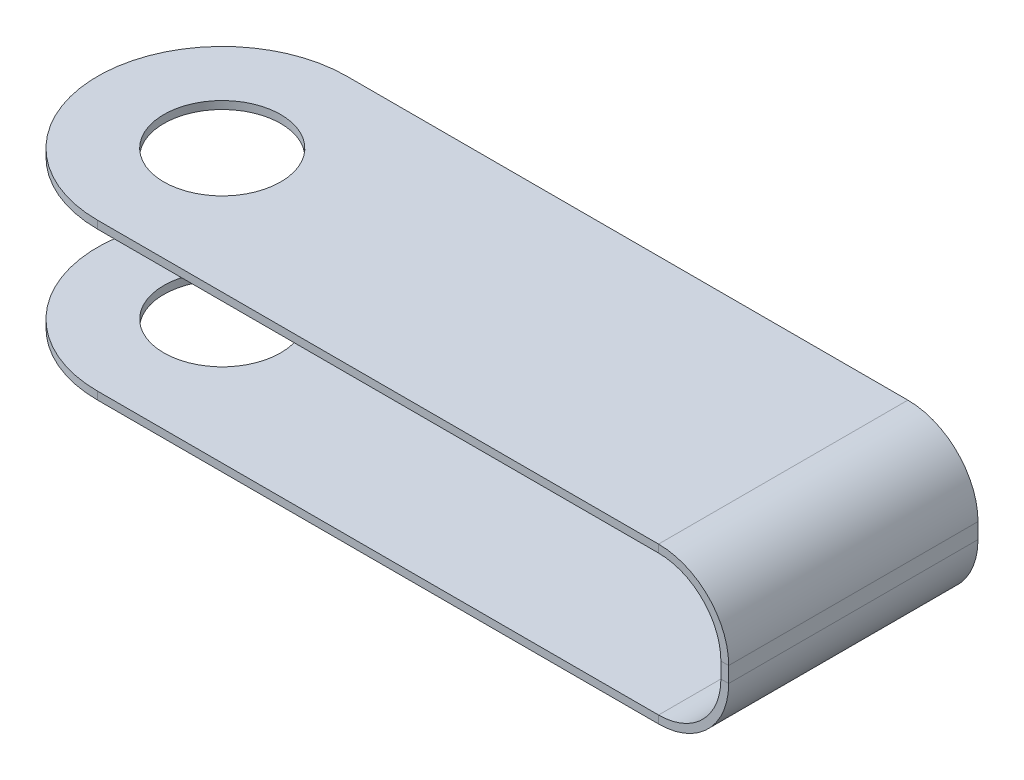
ISO-10303-21;
HEADER;
FILE_DESCRIPTION(('STEP AP214'),'2;1');
FILE_NAME('part.step','',(''),(''),'','','');
FILE_SCHEMA(('AUTOMOTIVE_DESIGN { 1 0 10303 214 1 1 1 1 }'));
ENDSEC;
DATA;
#1=APPLICATION_CONTEXT('core data for automotive mechanical design processes');
#2=APPLICATION_PROTOCOL_DEFINITION('international standard','automotive_design',2000,#1);
#3=PRODUCT_CONTEXT('',#1,'mechanical');
#4=PRODUCT('Part','Part','',(#3));
#5=PRODUCT_RELATED_PRODUCT_CATEGORY('part','',(#4));
#6=PRODUCT_DEFINITION_FORMATION('','',#4);
#7=PRODUCT_DEFINITION_CONTEXT('part definition',#1,'design');
#8=PRODUCT_DEFINITION('design','',#6,#7);
#9=PRODUCT_DEFINITION_SHAPE('','',#8);
#10=(LENGTH_UNIT() NAMED_UNIT(*) SI_UNIT(.MILLI.,.METRE.));
#11=(NAMED_UNIT(*) PLANE_ANGLE_UNIT() SI_UNIT($,.RADIAN.));
#12=(NAMED_UNIT(*) SI_UNIT($,.STERADIAN.) SOLID_ANGLE_UNIT());
#13=UNCERTAINTY_MEASURE_WITH_UNIT(LENGTH_MEASURE(1.E-05),#10,'distance_accuracy_value','');
#14=(GEOMETRIC_REPRESENTATION_CONTEXT(3) GLOBAL_UNCERTAINTY_ASSIGNED_CONTEXT((#13)) GLOBAL_UNIT_ASSIGNED_CONTEXT((#10,
#11,#12)) REPRESENTATION_CONTEXT('',''));
#15=CARTESIAN_POINT('',(0.,0.,0.));
#16=DIRECTION('',(0.,0.,1.));
#17=DIRECTION('',(1.,0.,0.));
#18=AXIS2_PLACEMENT_3D('',#15,#16,#17);
#19=CARTESIAN_POINT('',(44.,9.5,16.));
#20=DIRECTION('',(0.,-1.,0.));
#21=DIRECTION('',(1.,0.,0.));
#22=AXIS2_PLACEMENT_3D('',#19,#20,#21);
#23=PLANE('',#22);
#24=CARTESIAN_POINT('',(8.,9.49999999999999,8.));
#25=DIRECTION('',(0.,-1.,0.));
#26=DIRECTION('',(1.,0.,0.));
#27=AXIS2_PLACEMENT_3D('',#24,#25,#26);
#28=CIRCLE('',#27,3.75);
#29=CARTESIAN_POINT('',(11.75,9.49999999999999,8.));
#30=VERTEX_POINT('',#29);
#31=EDGE_CURVE('E294',#30,#30,#28,.F.);
#32=ORIENTED_EDGE('',*,*,#31,.F.);
#33=EDGE_LOOP('',(#32));
#34=FACE_BOUND('',#33,.T.);
#35=DIRECTION('',(-1.,0.,0.));
#36=VECTOR('',#35,1.);
#37=CARTESIAN_POINT('',(44.,9.5,0.));
#38=LINE('',#37,#36);
#39=CARTESIAN_POINT('',(44.,9.5,0.));
#40=VERTEX_POINT('',#39);
#41=CARTESIAN_POINT('',(8.,9.49999999999999,0.));
#42=VERTEX_POINT('',#41);
#43=EDGE_CURVE('E143',#40,#42,#38,.T.);
#44=ORIENTED_EDGE('',*,*,#43,.T.);
#45=CARTESIAN_POINT('',(8.,9.5,8.));
#46=DIRECTION('',(0.,1.,0.));
#47=DIRECTION('',(0.,0.,-1.));
#48=AXIS2_PLACEMENT_3D('',#45,#46,#47);
#49=CIRCLE('',#48,8.);
#50=CARTESIAN_POINT('',(8.,9.5,16.));
#51=VERTEX_POINT('',#50);
#52=EDGE_CURVE('E63',#42,#51,#49,.T.);
#53=ORIENTED_EDGE('',*,*,#52,.T.);
#54=DIRECTION('',(-1.,0.,0.));
#55=VECTOR('',#54,1.);
#56=CARTESIAN_POINT('',(44.,9.5,16.));
#57=LINE('',#56,#55);
#58=CARTESIAN_POINT('',(44.,9.5,16.));
#59=VERTEX_POINT('',#58);
#60=EDGE_CURVE('E141',#59,#51,#57,.T.);
#61=ORIENTED_EDGE('',*,*,#60,.F.);
#62=DIRECTION('',(0.,0.,-1.));
#63=VECTOR('',#62,1.);
#64=CARTESIAN_POINT('',(44.,9.5,16.));
#65=LINE('',#64,#63);
#66=EDGE_CURVE('E179',#59,#40,#65,.T.);
#67=ORIENTED_EDGE('',*,*,#66,.T.);
#68=EDGE_LOOP('',(#44,#53,#61,#67));
#69=FACE_BOUND('',#68,.T.);
#70=ADVANCED_FACE('F40',(#34,#69),#23,.F.);
#71=CARTESIAN_POINT('',(44.,9.,16.));
#72=DIRECTION('',(0.,-1.,0.));
#73=DIRECTION('',(1.,0.,0.));
#74=AXIS2_PLACEMENT_3D('',#71,#72,#73);
#75=PLANE('',#74);
#76=CARTESIAN_POINT('',(8.,8.99999999999999,8.));
#77=DIRECTION('',(0.,-1.,0.));
#78=DIRECTION('',(1.,0.,0.));
#79=AXIS2_PLACEMENT_3D('',#76,#77,#78);
#80=CIRCLE('',#79,3.75);
#81=CARTESIAN_POINT('',(11.75,8.99999999999999,8.));
#82=VERTEX_POINT('',#81);
#83=EDGE_CURVE('E290',#82,#82,#80,.T.);
#84=ORIENTED_EDGE('',*,*,#83,.F.);
#85=EDGE_LOOP('',(#84));
#86=FACE_BOUND('',#85,.T.);
#87=CARTESIAN_POINT('',(8.,8.99999999999999,8.));
#88=DIRECTION('',(0.,-1.,0.));
#89=DIRECTION('',(1.,0.,0.));
#90=AXIS2_PLACEMENT_3D('',#87,#88,#89);
#91=CIRCLE('',#90,8.);
#92=CARTESIAN_POINT('',(8.,8.99999999999999,0.));
#93=VERTEX_POINT('',#92);
#94=CARTESIAN_POINT('',(8.,8.99999999999999,16.));
#95=VERTEX_POINT('',#94);
#96=EDGE_CURVE('E129',#93,#95,#91,.F.);
#97=ORIENTED_EDGE('',*,*,#96,.F.);
#98=DIRECTION('',(-1.,0.,0.));
#99=VECTOR('',#98,1.);
#100=CARTESIAN_POINT('',(44.,9.,0.));
#101=LINE('',#100,#99);
#102=CARTESIAN_POINT('',(44.,9.,0.));
#103=VERTEX_POINT('',#102);
#104=EDGE_CURVE('E181',#103,#93,#101,.T.);
#105=ORIENTED_EDGE('',*,*,#104,.F.);
#106=DIRECTION('',(0.,0.,-1.));
#107=VECTOR('',#106,1.);
#108=CARTESIAN_POINT('',(44.,9.,16.));
#109=LINE('',#108,#107);
#110=CARTESIAN_POINT('',(44.,9.,16.));
#111=VERTEX_POINT('',#110);
#112=EDGE_CURVE('E221',#111,#103,#109,.T.);
#113=ORIENTED_EDGE('',*,*,#112,.F.);
#114=DIRECTION('',(-1.,0.,0.));
#115=VECTOR('',#114,1.);
#116=CARTESIAN_POINT('',(44.,9.,16.));
#117=LINE('',#116,#115);
#118=EDGE_CURVE('E148',#111,#95,#117,.T.);
#119=ORIENTED_EDGE('',*,*,#118,.T.);
#120=EDGE_LOOP('',(#97,#105,#113,#119));
#121=FACE_BOUND('',#120,.T.);
#122=ADVANCED_FACE('F273',(#86,#121),#75,.T.);
#123=CARTESIAN_POINT('',(0.,0.,16.));
#124=DIRECTION('',(0.,1.,0.));
#125=DIRECTION('',(0.,0.,1.));
#126=AXIS2_PLACEMENT_3D('',#123,#124,#125);
#127=PLANE('',#126);
#128=CARTESIAN_POINT('',(8.,0.,8.));
#129=DIRECTION('',(0.,1.,0.));
#130=DIRECTION('',(0.,0.,1.));
#131=AXIS2_PLACEMENT_3D('',#128,#129,#130);
#132=CIRCLE('',#131,3.75);
#133=CARTESIAN_POINT('',(8.,0.,11.75));
#134=VERTEX_POINT('',#133);
#135=EDGE_CURVE('E297',#134,#134,#132,.T.);
#136=ORIENTED_EDGE('',*,*,#135,.F.);
#137=EDGE_LOOP('',(#136));
#138=FACE_BOUND('',#137,.T.);
#139=CARTESIAN_POINT('',(8.,0.,8.));
#140=DIRECTION('',(0.,1.,0.));
#141=DIRECTION('',(0.,0.,1.));
#142=AXIS2_PLACEMENT_3D('',#139,#140,#141);
#143=CIRCLE('',#142,8.);
#144=CARTESIAN_POINT('',(8.,0.,16.));
#145=VERTEX_POINT('',#144);
#146=CARTESIAN_POINT('',(8.,0.,0.));
#147=VERTEX_POINT('',#146);
#148=EDGE_CURVE('E287',#145,#147,#143,.F.);
#149=ORIENTED_EDGE('',*,*,#148,.F.);
#150=DIRECTION('',(1.,0.,0.));
#151=VECTOR('',#150,1.);
#152=CARTESIAN_POINT('',(0.,0.,16.));
#153=LINE('',#152,#151);
#154=CARTESIAN_POINT('',(44.,0.,16.));
#155=VERTEX_POINT('',#154);
#156=EDGE_CURVE('E167',#145,#155,#153,.T.);
#157=ORIENTED_EDGE('',*,*,#156,.T.);
#158=DIRECTION('',(0.,0.,-1.));
#159=VECTOR('',#158,1.);
#160=CARTESIAN_POINT('',(44.,0.,16.));
#161=LINE('',#160,#159);
#162=CARTESIAN_POINT('',(44.,0.,0.));
#163=VERTEX_POINT('',#162);
#164=EDGE_CURVE('E212',#155,#163,#161,.T.);
#165=ORIENTED_EDGE('',*,*,#164,.T.);
#166=DIRECTION('',(1.,0.,0.));
#167=VECTOR('',#166,1.);
#168=CARTESIAN_POINT('',(0.,0.,0.));
#169=LINE('',#168,#167);
#170=EDGE_CURVE('E193',#147,#163,#169,.T.);
#171=ORIENTED_EDGE('',*,*,#170,.F.);
#172=EDGE_LOOP('',(#149,#157,#165,#171));
#173=FACE_BOUND('',#172,.T.);
#174=ADVANCED_FACE('F309',(#138,#173),#127,.T.);
#175=CARTESIAN_POINT('',(0.,-0.5,16.));
#176=DIRECTION('',(0.,1.,0.));
#177=DIRECTION('',(0.,0.,1.));
#178=AXIS2_PLACEMENT_3D('',#175,#176,#177);
#179=PLANE('',#178);
#180=CARTESIAN_POINT('',(8.,-0.5,8.));
#181=DIRECTION('',(0.,-1.,0.));
#182=DIRECTION('',(0.,0.,-1.));
#183=AXIS2_PLACEMENT_3D('',#180,#181,#182);
#184=CIRCLE('',#183,3.75);
#185=CARTESIAN_POINT('',(8.,-0.5,4.25));
#186=VERTEX_POINT('',#185);
#187=EDGE_CURVE('E300',#186,#186,#184,.T.);
#188=ORIENTED_EDGE('',*,*,#187,.F.);
#189=EDGE_LOOP('',(#188));
#190=FACE_BOUND('',#189,.T.);
#191=DIRECTION('',(1.,0.,0.));
#192=VECTOR('',#191,1.);
#193=CARTESIAN_POINT('',(0.,-0.5,16.));
#194=LINE('',#193,#192);
#195=CARTESIAN_POINT('',(8.,-0.5,16.));
#196=VERTEX_POINT('',#195);
#197=CARTESIAN_POINT('',(44.,-0.5,16.));
#198=VERTEX_POINT('',#197);
#199=EDGE_CURVE('E169',#196,#198,#194,.T.);
#200=ORIENTED_EDGE('',*,*,#199,.F.);
#201=CARTESIAN_POINT('',(8.,-0.5,8.));
#202=DIRECTION('',(0.,1.,0.));
#203=DIRECTION('',(0.,0.,-1.));
#204=AXIS2_PLACEMENT_3D('',#201,#202,#203);
#205=CIRCLE('',#204,8.);
#206=CARTESIAN_POINT('',(8.,-0.5,0.));
#207=VERTEX_POINT('',#206);
#208=EDGE_CURVE('E55',#207,#196,#205,.T.);
#209=ORIENTED_EDGE('',*,*,#208,.F.);
#210=DIRECTION('',(1.,0.,0.));
#211=VECTOR('',#210,1.);
#212=CARTESIAN_POINT('',(0.,-0.5,0.));
#213=LINE('',#212,#211);
#214=CARTESIAN_POINT('',(44.,-0.5,0.));
#215=VERTEX_POINT('',#214);
#216=EDGE_CURVE('E195',#207,#215,#213,.T.);
#217=ORIENTED_EDGE('',*,*,#216,.T.);
#218=DIRECTION('',(0.,0.,-1.));
#219=VECTOR('',#218,1.);
#220=CARTESIAN_POINT('',(44.,-0.5,16.));
#221=LINE('',#220,#219);
#222=EDGE_CURVE('E209',#198,#215,#221,.T.);
#223=ORIENTED_EDGE('',*,*,#222,.F.);
#224=EDGE_LOOP('',(#200,#209,#217,#223));
#225=FACE_BOUND('',#224,.T.);
#226=ADVANCED_FACE('F306',(#190,#225),#179,.F.);
#227=CARTESIAN_POINT('',(48.,4.,16.));
#228=DIRECTION('',(0.,0.,1.));
#229=DIRECTION('',(1.,0.,0.));
#230=AXIS2_PLACEMENT_3D('',#227,#228,#229);
#231=PLANE('',#230);
#232=DIRECTION('',(1.,0.,0.));
#233=VECTOR('',#232,1.);
#234=CARTESIAN_POINT('',(48.,4.,16.));
#235=LINE('',#234,#233);
#236=CARTESIAN_POINT('',(48.,4.,16.));
#237=VERTEX_POINT('',#236);
#238=CARTESIAN_POINT('',(48.5,4.,16.));
#239=VERTEX_POINT('',#238);
#240=EDGE_CURVE('E11',#237,#239,#235,.T.);
#241=ORIENTED_EDGE('',*,*,#240,.F.);
#242=CARTESIAN_POINT('',(44.,4.,16.));
#243=DIRECTION('',(0.,0.,1.));
#244=DIRECTION('',(1.,0.,0.));
#245=AXIS2_PLACEMENT_3D('',#242,#243,#244);
#246=CIRCLE('',#245,4.);
#247=EDGE_CURVE('E164',#155,#237,#246,.T.);
#248=ORIENTED_EDGE('',*,*,#247,.F.);
#249=DIRECTION('',(0.,1.,0.));
#250=VECTOR('',#249,1.);
#251=CARTESIAN_POINT('',(44.,-0.5,16.));
#252=LINE('',#251,#250);
#253=EDGE_CURVE('E48',#198,#155,#252,.T.);
#254=ORIENTED_EDGE('',*,*,#253,.F.);
#255=CARTESIAN_POINT('',(44.,4.,16.));
#256=DIRECTION('',(0.,0.,1.));
#257=DIRECTION('',(1.,0.,0.));
#258=AXIS2_PLACEMENT_3D('',#255,#256,#257);
#259=CIRCLE('',#258,4.5);
#260=EDGE_CURVE('E171',#198,#239,#259,.T.);
#261=ORIENTED_EDGE('',*,*,#260,.T.);
#262=EDGE_LOOP('',(#241,#248,#254,#261));
#263=FACE_BOUND('',#262,.T.);
#264=ADVANCED_FACE('F42',(#263),#231,.T.);
#265=CARTESIAN_POINT('',(44.,-0.5,16.));
#266=DIRECTION('',(0.,0.,1.));
#267=DIRECTION('',(1.,0.,0.));
#268=AXIS2_PLACEMENT_3D('',#265,#266,#267);
#269=PLANE('',#268);
#270=DIRECTION('',(0.,1.,0.));
#271=VECTOR('',#270,1.);
#272=CARTESIAN_POINT('',(48.,4.00000000000003,16.));
#273=LINE('',#272,#271);
#274=CARTESIAN_POINT('',(48.,5.,16.));
#275=VERTEX_POINT('',#274);
#276=EDGE_CURVE('E161',#237,#275,#273,.T.);
#277=ORIENTED_EDGE('',*,*,#276,.F.);
#278=ORIENTED_EDGE('',*,*,#240,.T.);
#279=DIRECTION('',(0.,1.,0.));
#280=VECTOR('',#279,1.);
#281=CARTESIAN_POINT('',(48.5,4.00000000000003,16.));
#282=LINE('',#281,#280);
#283=CARTESIAN_POINT('',(48.5,5.,16.));
#284=VERTEX_POINT('',#283);
#285=EDGE_CURVE('E174',#239,#284,#282,.T.);
#286=ORIENTED_EDGE('',*,*,#285,.T.);
#287=DIRECTION('',(-1.,0.,0.));
#288=VECTOR('',#287,1.);
#289=CARTESIAN_POINT('',(48.5,5.,16.));
#290=LINE('',#289,#288);
#291=EDGE_CURVE('E228',#284,#275,#290,.T.);
#292=ORIENTED_EDGE('',*,*,#291,.T.);
#293=EDGE_LOOP('',(#277,#278,#286,#292));
#294=FACE_BOUND('',#293,.T.);
#295=ADVANCED_FACE('F258',(#294),#269,.T.);
#296=CARTESIAN_POINT('',(44.,0.,0.));
#297=DIRECTION('',(0.,0.,-1.));
#298=DIRECTION('',(-1.,0.,0.));
#299=AXIS2_PLACEMENT_3D('',#296,#297,#298);
#300=PLANE('',#299);
#301=DIRECTION('',(0.,-1.,0.));
#302=VECTOR('',#301,1.);
#303=CARTESIAN_POINT('',(44.,0.,0.));
#304=LINE('',#303,#302);
#305=EDGE_CURVE('E233',#163,#215,#304,.T.);
#306=ORIENTED_EDGE('',*,*,#305,.F.);
#307=CARTESIAN_POINT('',(44.,4.,0.));
#308=DIRECTION('',(0.,0.,1.));
#309=DIRECTION('',(1.,0.,0.));
#310=AXIS2_PLACEMENT_3D('',#307,#308,#309);
#311=CIRCLE('',#310,4.);
#312=CARTESIAN_POINT('',(48.,4.,0.));
#313=VERTEX_POINT('',#312);
#314=EDGE_CURVE('E190',#163,#313,#311,.T.);
#315=ORIENTED_EDGE('',*,*,#314,.T.);
#316=DIRECTION('',(-1.,0.,0.));
#317=VECTOR('',#316,1.);
#318=CARTESIAN_POINT('',(48.5,4.,0.));
#319=LINE('',#318,#317);
#320=CARTESIAN_POINT('',(48.5,4.,0.));
#321=VERTEX_POINT('',#320);
#322=EDGE_CURVE('E231',#321,#313,#319,.T.);
#323=ORIENTED_EDGE('',*,*,#322,.F.);
#324=CARTESIAN_POINT('',(44.,4.,0.));
#325=DIRECTION('',(0.,0.,1.));
#326=DIRECTION('',(1.,0.,0.));
#327=AXIS2_PLACEMENT_3D('',#324,#325,#326);
#328=CIRCLE('',#327,4.5);
#329=EDGE_CURVE('E197',#215,#321,#328,.T.);
#330=ORIENTED_EDGE('',*,*,#329,.F.);
#331=EDGE_LOOP('',(#306,#315,#323,#330));
#332=FACE_BOUND('',#331,.T.);
#333=ADVANCED_FACE('F317',(#332),#300,.T.);
#334=CARTESIAN_POINT('',(48.5,4.,0.));
#335=DIRECTION('',(0.,0.,-1.));
#336=DIRECTION('',(-1.,0.,0.));
#337=AXIS2_PLACEMENT_3D('',#334,#335,#336);
#338=PLANE('',#337);
#339=DIRECTION('',(0.,-1.,0.));
#340=VECTOR('',#339,1.);
#341=CARTESIAN_POINT('',(8.,9.5,0.));
#342=LINE('',#341,#340);
#343=EDGE_CURVE('E134',#147,#207,#342,.T.);
#344=ORIENTED_EDGE('',*,*,#343,.F.);
#345=ORIENTED_EDGE('',*,*,#170,.T.);
#346=ORIENTED_EDGE('',*,*,#305,.T.);
#347=ORIENTED_EDGE('',*,*,#216,.F.);
#348=EDGE_LOOP('',(#344,#345,#346,#347));
#349=FACE_BOUND('',#348,.T.);
#350=ADVANCED_FACE('F320',(#349),#338,.T.);
#351=CARTESIAN_POINT('',(44.,9.,16.));
#352=DIRECTION('',(0.,0.,1.));
#353=DIRECTION('',(1.,0.,0.));
#354=AXIS2_PLACEMENT_3D('',#351,#352,#353);
#355=PLANE('',#354);
#356=DIRECTION('',(0.,1.,0.));
#357=VECTOR('',#356,1.);
#358=CARTESIAN_POINT('',(44.,9.,16.));
#359=LINE('',#358,#357);
#360=EDGE_CURVE('E146',#111,#59,#359,.T.);
#361=ORIENTED_EDGE('',*,*,#360,.F.);
#362=CARTESIAN_POINT('',(44.,5.,16.));
#363=DIRECTION('',(0.,0.,1.));
#364=DIRECTION('',(1.,0.,0.));
#365=AXIS2_PLACEMENT_3D('',#362,#363,#364);
#366=CIRCLE('',#365,4.);
#367=EDGE_CURVE('E151',#275,#111,#366,.T.);
#368=ORIENTED_EDGE('',*,*,#367,.F.);
#369=ORIENTED_EDGE('',*,*,#291,.F.);
#370=CARTESIAN_POINT('',(44.,5.,16.));
#371=DIRECTION('',(0.,0.,1.));
#372=DIRECTION('',(1.,0.,0.));
#373=AXIS2_PLACEMENT_3D('',#370,#371,#372);
#374=CIRCLE('',#373,4.5);
#375=EDGE_CURVE('E177',#284,#59,#374,.T.);
#376=ORIENTED_EDGE('',*,*,#375,.T.);
#377=EDGE_LOOP('',(#361,#368,#369,#376));
#378=FACE_BOUND('',#377,.T.);
#379=ADVANCED_FACE('F267',(#378),#355,.T.);
#380=CARTESIAN_POINT('',(48.5,5.,16.));
#381=DIRECTION('',(0.,0.,1.));
#382=DIRECTION('',(1.,0.,0.));
#383=AXIS2_PLACEMENT_3D('',#380,#381,#382);
#384=PLANE('',#383);
#385=DIRECTION('',(0.,-1.,0.));
#386=VECTOR('',#385,1.);
#387=CARTESIAN_POINT('',(8.,9.5,16.));
#388=LINE('',#387,#386);
#389=EDGE_CURVE('E126',#51,#95,#388,.T.);
#390=ORIENTED_EDGE('',*,*,#389,.T.);
#391=ORIENTED_EDGE('',*,*,#118,.F.);
#392=ORIENTED_EDGE('',*,*,#360,.T.);
#393=ORIENTED_EDGE('',*,*,#60,.T.);
#394=EDGE_LOOP('',(#390,#391,#392,#393));
#395=FACE_BOUND('',#394,.T.);
#396=ADVANCED_FACE('F145',(#395),#384,.T.);
#397=CARTESIAN_POINT('',(48.,5.,0.));
#398=DIRECTION('',(0.,0.,-1.));
#399=DIRECTION('',(-1.,0.,0.));
#400=AXIS2_PLACEMENT_3D('',#397,#398,#399);
#401=PLANE('',#400);
#402=DIRECTION('',(1.,0.,0.));
#403=VECTOR('',#402,1.);
#404=CARTESIAN_POINT('',(48.,5.,0.));
#405=LINE('',#404,#403);
#406=CARTESIAN_POINT('',(48.,5.,0.));
#407=VERTEX_POINT('',#406);
#408=CARTESIAN_POINT('',(48.5,5.,0.));
#409=VERTEX_POINT('',#408);
#410=EDGE_CURVE('E226',#407,#409,#405,.T.);
#411=ORIENTED_EDGE('',*,*,#410,.F.);
#412=CARTESIAN_POINT('',(44.,5.,0.));
#413=DIRECTION('',(0.,0.,1.));
#414=DIRECTION('',(1.,0.,0.));
#415=AXIS2_PLACEMENT_3D('',#412,#413,#414);
#416=CIRCLE('',#415,4.);
#417=EDGE_CURVE('E184',#407,#103,#416,.T.);
#418=ORIENTED_EDGE('',*,*,#417,.T.);
#419=DIRECTION('',(0.,-1.,0.));
#420=VECTOR('',#419,1.);
#421=CARTESIAN_POINT('',(44.,9.5,0.));
#422=LINE('',#421,#420);
#423=EDGE_CURVE('E224',#40,#103,#422,.T.);
#424=ORIENTED_EDGE('',*,*,#423,.F.);
#425=CARTESIAN_POINT('',(44.,5.,0.));
#426=DIRECTION('',(0.,0.,1.));
#427=DIRECTION('',(1.,0.,0.));
#428=AXIS2_PLACEMENT_3D('',#425,#426,#427);
#429=CIRCLE('',#428,4.5);
#430=EDGE_CURVE('E149',#409,#40,#429,.T.);
#431=ORIENTED_EDGE('',*,*,#430,.F.);
#432=EDGE_LOOP('',(#411,#418,#424,#431));
#433=FACE_BOUND('',#432,.T.);
#434=ADVANCED_FACE('F276',(#433),#401,.T.);
#435=CARTESIAN_POINT('',(44.,9.5,0.));
#436=DIRECTION('',(0.,0.,-1.));
#437=DIRECTION('',(-1.,0.,0.));
#438=AXIS2_PLACEMENT_3D('',#435,#436,#437);
#439=PLANE('',#438);
#440=DIRECTION('',(0.,1.,0.));
#441=VECTOR('',#440,1.);
#442=CARTESIAN_POINT('',(48.,4.00000000000003,0.));
#443=LINE('',#442,#441);
#444=EDGE_CURVE('E187',#313,#407,#443,.T.);
#445=ORIENTED_EDGE('',*,*,#444,.T.);
#446=ORIENTED_EDGE('',*,*,#410,.T.);
#447=DIRECTION('',(0.,1.,0.));
#448=VECTOR('',#447,1.);
#449=CARTESIAN_POINT('',(48.5,4.00000000000003,0.));
#450=LINE('',#449,#448);
#451=EDGE_CURVE('E154',#321,#409,#450,.T.);
#452=ORIENTED_EDGE('',*,*,#451,.F.);
#453=ORIENTED_EDGE('',*,*,#322,.T.);
#454=EDGE_LOOP('',(#445,#446,#452,#453));
#455=FACE_BOUND('',#454,.T.);
#456=ADVANCED_FACE('F280',(#455),#439,.T.);
#457=CARTESIAN_POINT('',(44.,5.,16.));
#458=DIRECTION('',(0.,0.,-1.));
#459=DIRECTION('',(-1.,0.,0.));
#460=AXIS2_PLACEMENT_3D('',#457,#458,#459);
#461=CYLINDRICAL_SURFACE('',#460,4.);
#462=ORIENTED_EDGE('',*,*,#417,.F.);
#463=DIRECTION('',(0.,0.,-1.));
#464=VECTOR('',#463,1.);
#465=CARTESIAN_POINT('',(48.,5.,16.));
#466=LINE('',#465,#464);
#467=EDGE_CURVE('E218',#275,#407,#466,.T.);
#468=ORIENTED_EDGE('',*,*,#467,.F.);
#469=ORIENTED_EDGE('',*,*,#367,.T.);
#470=ORIENTED_EDGE('',*,*,#112,.T.);
#471=EDGE_LOOP('',(#462,#468,#469,#470));
#472=FACE_BOUND('',#471,.T.);
#473=ADVANCED_FACE('F266',(#472),#461,.F.);
#474=CARTESIAN_POINT('',(48.,4.00000000000003,16.));
#475=DIRECTION('',(-1.,0.,0.));
#476=DIRECTION('',(0.,-1.,0.));
#477=AXIS2_PLACEMENT_3D('',#474,#475,#476);
#478=PLANE('',#477);
#479=ORIENTED_EDGE('',*,*,#444,.F.);
#480=DIRECTION('',(0.,0.,-1.));
#481=VECTOR('',#480,1.);
#482=CARTESIAN_POINT('',(48.,4.,16.));
#483=LINE('',#482,#481);
#484=EDGE_CURVE('E215',#237,#313,#483,.T.);
#485=ORIENTED_EDGE('',*,*,#484,.F.);
#486=ORIENTED_EDGE('',*,*,#276,.T.);
#487=ORIENTED_EDGE('',*,*,#467,.T.);
#488=EDGE_LOOP('',(#479,#485,#486,#487));
#489=FACE_BOUND('',#488,.T.);
#490=ADVANCED_FACE('F257',(#489),#478,.T.);
#491=CARTESIAN_POINT('',(44.,4.,16.));
#492=DIRECTION('',(0.,0.,-1.));
#493=DIRECTION('',(-1.,0.,0.));
#494=AXIS2_PLACEMENT_3D('',#491,#492,#493);
#495=CYLINDRICAL_SURFACE('',#494,4.);
#496=ORIENTED_EDGE('',*,*,#314,.F.);
#497=ORIENTED_EDGE('',*,*,#164,.F.);
#498=ORIENTED_EDGE('',*,*,#247,.T.);
#499=ORIENTED_EDGE('',*,*,#484,.T.);
#500=EDGE_LOOP('',(#496,#497,#498,#499));
#501=FACE_BOUND('',#500,.T.);
#502=ADVANCED_FACE('F247',(#501),#495,.F.);
#503=CARTESIAN_POINT('',(44.,4.,16.));
#504=DIRECTION('',(0.,0.,-1.));
#505=DIRECTION('',(-1.,0.,0.));
#506=AXIS2_PLACEMENT_3D('',#503,#504,#505);
#507=CYLINDRICAL_SURFACE('',#506,4.5);
#508=ORIENTED_EDGE('',*,*,#329,.T.);
#509=DIRECTION('',(0.,0.,-1.));
#510=VECTOR('',#509,1.);
#511=CARTESIAN_POINT('',(48.5,4.,16.));
#512=LINE('',#511,#510);
#513=EDGE_CURVE('E206',#239,#321,#512,.T.);
#514=ORIENTED_EDGE('',*,*,#513,.F.);
#515=ORIENTED_EDGE('',*,*,#260,.F.);
#516=ORIENTED_EDGE('',*,*,#222,.T.);
#517=EDGE_LOOP('',(#508,#514,#515,#516));
#518=FACE_BOUND('',#517,.T.);
#519=ADVANCED_FACE('F314',(#518),#507,.T.);
#520=CARTESIAN_POINT('',(48.5,4.00000000000003,16.));
#521=DIRECTION('',(-1.,0.,0.));
#522=DIRECTION('',(0.,-1.,0.));
#523=AXIS2_PLACEMENT_3D('',#520,#521,#522);
#524=PLANE('',#523);
#525=ORIENTED_EDGE('',*,*,#451,.T.);
#526=DIRECTION('',(0.,0.,-1.));
#527=VECTOR('',#526,1.);
#528=CARTESIAN_POINT('',(48.5,5.,16.));
#529=LINE('',#528,#527);
#530=EDGE_CURVE('E203',#284,#409,#529,.T.);
#531=ORIENTED_EDGE('',*,*,#530,.F.);
#532=ORIENTED_EDGE('',*,*,#285,.F.);
#533=ORIENTED_EDGE('',*,*,#513,.T.);
#534=EDGE_LOOP('',(#525,#531,#532,#533));
#535=FACE_BOUND('',#534,.T.);
#536=ADVANCED_FACE('F282',(#535),#524,.F.);
#537=CARTESIAN_POINT('',(44.,5.,16.));
#538=DIRECTION('',(0.,0.,-1.));
#539=DIRECTION('',(-1.,0.,0.));
#540=AXIS2_PLACEMENT_3D('',#537,#538,#539);
#541=CYLINDRICAL_SURFACE('',#540,4.5);
#542=ORIENTED_EDGE('',*,*,#430,.T.);
#543=ORIENTED_EDGE('',*,*,#66,.F.);
#544=ORIENTED_EDGE('',*,*,#375,.F.);
#545=ORIENTED_EDGE('',*,*,#530,.T.);
#546=EDGE_LOOP('',(#542,#543,#544,#545));
#547=FACE_BOUND('',#546,.T.);
#548=ADVANCED_FACE('F284',(#547),#541,.T.);
#549=CARTESIAN_POINT('',(44.,5.,16.));
#550=DIRECTION('',(0.,0.,1.));
#551=DIRECTION('',(1.,0.,0.));
#552=AXIS2_PLACEMENT_3D('',#549,#550,#551);
#553=PLANE('',#552);
#554=EDGE_CURVE('E135',#145,#196,#388,.T.);
#555=ORIENTED_EDGE('',*,*,#554,.T.);
#556=ORIENTED_EDGE('',*,*,#199,.T.);
#557=ORIENTED_EDGE('',*,*,#253,.T.);
#558=ORIENTED_EDGE('',*,*,#156,.F.);
#559=EDGE_LOOP('',(#555,#556,#557,#558));
#560=FACE_BOUND('',#559,.T.);
#561=ADVANCED_FACE('F240',(#560),#553,.T.);
#562=CARTESIAN_POINT('',(44.,5.,0.));
#563=DIRECTION('',(0.,0.,1.));
#564=DIRECTION('',(1.,0.,0.));
#565=AXIS2_PLACEMENT_3D('',#562,#563,#564);
#566=PLANE('',#565);
#567=ORIENTED_EDGE('',*,*,#104,.T.);
#568=EDGE_CURVE('E286',#42,#93,#342,.T.);
#569=ORIENTED_EDGE('',*,*,#568,.F.);
#570=ORIENTED_EDGE('',*,*,#43,.F.);
#571=ORIENTED_EDGE('',*,*,#423,.T.);
#572=EDGE_LOOP('',(#567,#569,#570,#571));
#573=FACE_BOUND('',#572,.T.);
#574=ADVANCED_FACE('F285',(#573),#566,.F.);
#575=CARTESIAN_POINT('',(8.,9.5,8.));
#576=DIRECTION('',(0.,-1.,0.));
#577=DIRECTION('',(0.,0.,-1.));
#578=AXIS2_PLACEMENT_3D('',#575,#576,#577);
#579=CYLINDRICAL_SURFACE('',#578,8.);
#580=ORIENTED_EDGE('',*,*,#96,.T.);
#581=ORIENTED_EDGE('',*,*,#389,.F.);
#582=ORIENTED_EDGE('',*,*,#52,.F.);
#583=ORIENTED_EDGE('',*,*,#568,.T.);
#584=EDGE_LOOP('',(#580,#581,#582,#583));
#585=FACE_BOUND('',#584,.T.);
#586=ADVANCED_FACE('F127',(#585),#579,.T.);
#587=ORIENTED_EDGE('',*,*,#148,.T.);
#588=ORIENTED_EDGE('',*,*,#343,.T.);
#589=ORIENTED_EDGE('',*,*,#208,.T.);
#590=ORIENTED_EDGE('',*,*,#554,.F.);
#591=EDGE_LOOP('',(#587,#588,#589,#590));
#592=FACE_BOUND('',#591,.T.);
#593=ADVANCED_FACE('F322',(#592),#579,.T.);
#594=CARTESIAN_POINT('',(8.,20.1066017177982,8.));
#595=DIRECTION('',(0.,-1.,0.));
#596=DIRECTION('',(1.,0.,0.));
#597=AXIS2_PLACEMENT_3D('',#594,#595,#596);
#598=CYLINDRICAL_SURFACE('',#597,3.75);
#599=ORIENTED_EDGE('',*,*,#83,.T.);
#600=EDGE_LOOP('',(#599));
#601=FACE_BOUND('',#600,.T.);
#602=ORIENTED_EDGE('',*,*,#31,.T.);
#603=EDGE_LOOP('',(#602));
#604=FACE_BOUND('',#603,.T.);
#605=ADVANCED_FACE('F324',(#601,#604),#598,.F.);
#606=CARTESIAN_POINT('',(8.,1.5,8.));
#607=DIRECTION('',(0.,-1.,0.));
#608=DIRECTION('',(0.,0.,-1.));
#609=AXIS2_PLACEMENT_3D('',#606,#607,#608);
#610=CYLINDRICAL_SURFACE('',#609,3.75);
#611=ORIENTED_EDGE('',*,*,#135,.T.);
#612=EDGE_LOOP('',(#611));
#613=FACE_BOUND('',#612,.T.);
#614=ORIENTED_EDGE('',*,*,#187,.T.);
#615=EDGE_LOOP('',(#614));
#616=FACE_BOUND('',#615,.T.);
#617=ADVANCED_FACE('F304',(#613,#616),#610,.F.);
#618=CLOSED_SHELL('',(#70,#122,#174,#226,#264,#295,#333,#350,#379,#396,#434,#456,#473,#490,#502,
#519,#536,#548,#561,#574,#586,#593,#605,#617));
#619=MANIFOLD_SOLID_BREP('B2',#618);
#620=ADVANCED_BREP_SHAPE_REPRESENTATION('',(#18,#619),#14);
#621=SHAPE_DEFINITION_REPRESENTATION(#9,#620);
ENDSEC;
END-ISO-10303-21;
